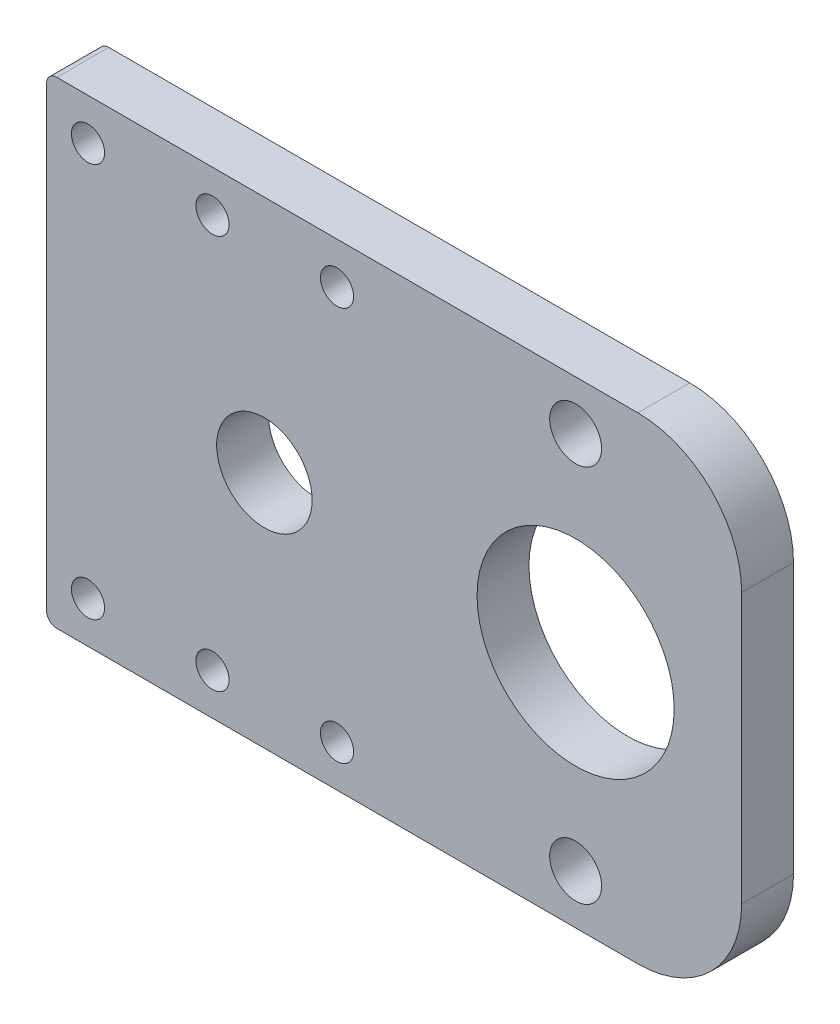
ISO-10303-21;
HEADER;
FILE_DESCRIPTION(('STEP AP214'),'2;1');
FILE_NAME('part.step','',(''),(''),'','','');
FILE_SCHEMA(('AUTOMOTIVE_DESIGN { 1 0 10303 214 1 1 1 1 }'));
ENDSEC;
DATA;
#1=APPLICATION_CONTEXT('core data for automotive mechanical design processes');
#2=APPLICATION_PROTOCOL_DEFINITION('international standard','automotive_design',2000,#1);
#3=PRODUCT_CONTEXT('',#1,'mechanical');
#4=PRODUCT('Part','Part','',(#3));
#5=PRODUCT_RELATED_PRODUCT_CATEGORY('part','',(#4));
#6=PRODUCT_DEFINITION_FORMATION('','',#4);
#7=PRODUCT_DEFINITION_CONTEXT('part definition',#1,'design');
#8=PRODUCT_DEFINITION('design','',#6,#7);
#9=PRODUCT_DEFINITION_SHAPE('','',#8);
#10=(LENGTH_UNIT() NAMED_UNIT(*) SI_UNIT(.MILLI.,.METRE.));
#11=(NAMED_UNIT(*) PLANE_ANGLE_UNIT() SI_UNIT($,.RADIAN.));
#12=(NAMED_UNIT(*) SI_UNIT($,.STERADIAN.) SOLID_ANGLE_UNIT());
#13=UNCERTAINTY_MEASURE_WITH_UNIT(LENGTH_MEASURE(1.E-05),#10,'distance_accuracy_value','');
#14=(GEOMETRIC_REPRESENTATION_CONTEXT(3) GLOBAL_UNCERTAINTY_ASSIGNED_CONTEXT((#13)) GLOBAL_UNIT_ASSIGNED_CONTEXT((#10,
#11,#12)) REPRESENTATION_CONTEXT('',''));
#15=CARTESIAN_POINT('',(0.,0.,0.));
#16=DIRECTION('',(0.,0.,1.));
#17=DIRECTION('',(1.,0.,0.));
#18=AXIS2_PLACEMENT_3D('',#15,#16,#17);
#19=CARTESIAN_POINT('',(0.,0.,5.));
#20=DIRECTION('',(0.,0.,1.));
#21=DIRECTION('',(1.,0.,0.));
#22=AXIS2_PLACEMENT_3D('',#19,#20,#21);
#23=PLANE('',#22);
#24=CARTESIAN_POINT('',(7.00000000000001,18.9999999999999,5.));
#25=DIRECTION('',(0.,0.,1.));
#26=DIRECTION('',(1.,0.,0.));
#27=AXIS2_PLACEMENT_3D('',#24,#25,#26);
#28=CIRCLE('',#27,1.6);
#29=CARTESIAN_POINT('',(8.60000000000001,18.9999999999999,5.));
#30=VERTEX_POINT('',#29);
#31=EDGE_CURVE('E181',#30,#30,#28,.F.);
#32=ORIENTED_EDGE('',*,*,#31,.T.);
#33=EDGE_LOOP('',(#32));
#34=FACE_BOUND('',#33,.T.);
#35=CARTESIAN_POINT('',(-4.99999999999999,-18.9999999999999,5.));
#36=DIRECTION('',(0.,0.,1.));
#37=DIRECTION('',(1.,0.,0.));
#38=AXIS2_PLACEMENT_3D('',#35,#36,#37);
#39=CIRCLE('',#38,1.6);
#40=CARTESIAN_POINT('',(-3.39999999999999,-18.9999999999999,5.));
#41=VERTEX_POINT('',#40);
#42=EDGE_CURVE('E174',#41,#41,#39,.F.);
#43=ORIENTED_EDGE('',*,*,#42,.T.);
#44=EDGE_LOOP('',(#43));
#45=FACE_BOUND('',#44,.T.);
#46=CARTESIAN_POINT('',(-17.,-18.9999999999999,5.));
#47=DIRECTION('',(0.,0.,1.));
#48=DIRECTION('',(1.,0.,0.));
#49=AXIS2_PLACEMENT_3D('',#46,#47,#48);
#50=CIRCLE('',#49,1.59999999999999);
#51=CARTESIAN_POINT('',(-15.4,-18.9999999999999,5.));
#52=VERTEX_POINT('',#51);
#53=EDGE_CURVE('E177',#52,#52,#50,.F.);
#54=ORIENTED_EDGE('',*,*,#53,.T.);
#55=EDGE_LOOP('',(#54));
#56=FACE_BOUND('',#55,.T.);
#57=CARTESIAN_POINT('',(30.,18.25,5.));
#58=DIRECTION('',(0.,0.,1.));
#59=DIRECTION('',(1.,0.,0.));
#60=AXIS2_PLACEMENT_3D('',#57,#58,#59);
#61=CIRCLE('',#60,2.5);
#62=CARTESIAN_POINT('',(32.5,18.25,5.));
#63=VERTEX_POINT('',#62);
#64=EDGE_CURVE('E192',#63,#63,#61,.T.);
#65=ORIENTED_EDGE('',*,*,#64,.F.);
#66=EDGE_LOOP('',(#65));
#67=FACE_BOUND('',#66,.T.);
#68=CARTESIAN_POINT('',(0.,0.,5.));
#69=DIRECTION('',(0.,0.,1.));
#70=DIRECTION('',(1.,0.,0.));
#71=AXIS2_PLACEMENT_3D('',#68,#69,#70);
#72=CIRCLE('',#71,4.6);
#73=CARTESIAN_POINT('',(4.6,0.,5.));
#74=VERTEX_POINT('',#73);
#75=EDGE_CURVE('E199',#74,#74,#72,.T.);
#76=ORIENTED_EDGE('',*,*,#75,.F.);
#77=EDGE_LOOP('',(#76));
#78=FACE_BOUND('',#77,.T.);
#79=CARTESIAN_POINT('',(30.,0.,5.));
#80=DIRECTION('',(0.,0.,1.));
#81=DIRECTION('',(1.,0.,0.));
#82=AXIS2_PLACEMENT_3D('',#79,#80,#81);
#83=CIRCLE('',#82,9.5);
#84=CARTESIAN_POINT('',(39.5,0.,5.));
#85=VERTEX_POINT('',#84);
#86=EDGE_CURVE('E202',#85,#85,#83,.T.);
#87=ORIENTED_EDGE('',*,*,#86,.F.);
#88=EDGE_LOOP('',(#87));
#89=FACE_BOUND('',#88,.T.);
#90=CARTESIAN_POINT('',(30.,-18.25,5.));
#91=DIRECTION('',(0.,0.,1.));
#92=DIRECTION('',(1.,0.,0.));
#93=AXIS2_PLACEMENT_3D('',#90,#91,#92);
#94=CIRCLE('',#93,2.5);
#95=CARTESIAN_POINT('',(32.5,-18.25,5.));
#96=VERTEX_POINT('',#95);
#97=EDGE_CURVE('E113',#96,#96,#94,.F.);
#98=ORIENTED_EDGE('',*,*,#97,.T.);
#99=EDGE_LOOP('',(#98));
#100=FACE_BOUND('',#99,.T.);
#101=CARTESIAN_POINT('',(7.00000000000001,-18.9999999999999,5.));
#102=DIRECTION('',(0.,0.,1.));
#103=DIRECTION('',(1.,0.,0.));
#104=AXIS2_PLACEMENT_3D('',#101,#102,#103);
#105=CIRCLE('',#104,1.6);
#106=CARTESIAN_POINT('',(8.60000000000001,-18.9999999999999,5.));
#107=VERTEX_POINT('',#106);
#108=EDGE_CURVE('E178',#107,#107,#105,.T.);
#109=ORIENTED_EDGE('',*,*,#108,.F.);
#110=EDGE_LOOP('',(#109));
#111=FACE_BOUND('',#110,.T.);
#112=CARTESIAN_POINT('',(-4.99999999999999,18.9999999999999,5.));
#113=DIRECTION('',(0.,0.,1.));
#114=DIRECTION('',(1.,0.,0.));
#115=AXIS2_PLACEMENT_3D('',#112,#113,#114);
#116=CIRCLE('',#115,1.6);
#117=CARTESIAN_POINT('',(-3.39999999999999,18.9999999999999,5.));
#118=VERTEX_POINT('',#117);
#119=EDGE_CURVE('E184',#118,#118,#116,.T.);
#120=ORIENTED_EDGE('',*,*,#119,.F.);
#121=EDGE_LOOP('',(#120));
#122=FACE_BOUND('',#121,.T.);
#123=CARTESIAN_POINT('',(-17.,18.9999999999999,5.));
#124=DIRECTION('',(0.,0.,1.));
#125=DIRECTION('',(1.,0.,0.));
#126=AXIS2_PLACEMENT_3D('',#123,#124,#125);
#127=CIRCLE('',#126,1.6);
#128=CARTESIAN_POINT('',(-15.4,18.9999999999999,5.));
#129=VERTEX_POINT('',#128);
#130=EDGE_CURVE('E170',#129,#129,#127,.T.);
#131=ORIENTED_EDGE('',*,*,#130,.F.);
#132=EDGE_LOOP('',(#131));
#133=FACE_BOUND('',#132,.T.);
#134=DIRECTION('',(-1.,0.,0.));
#135=VECTOR('',#134,1.);
#136=CARTESIAN_POINT('',(0.,23.,5.));
#137=LINE('',#136,#135);
#138=CARTESIAN_POINT('',(36.,23.,5.));
#139=VERTEX_POINT('',#138);
#140=CARTESIAN_POINT('',(-20.,23.,5.));
#141=VERTEX_POINT('',#140);
#142=EDGE_CURVE('E165',#139,#141,#137,.T.);
#143=ORIENTED_EDGE('',*,*,#142,.T.);
#144=CARTESIAN_POINT('',(-20.,22.,5.));
#145=DIRECTION('',(0.,0.,1.));
#146=DIRECTION('',(1.,0.,0.));
#147=AXIS2_PLACEMENT_3D('',#144,#145,#146);
#148=CIRCLE('',#147,1.);
#149=CARTESIAN_POINT('',(-21.,22.,5.));
#150=VERTEX_POINT('',#149);
#151=EDGE_CURVE('E139',#141,#150,#148,.T.);
#152=ORIENTED_EDGE('',*,*,#151,.T.);
#153=DIRECTION('',(0.,-1.,0.));
#154=VECTOR('',#153,1.);
#155=CARTESIAN_POINT('',(-21.,0.,5.));
#156=LINE('',#155,#154);
#157=CARTESIAN_POINT('',(-21.,-22.,5.));
#158=VERTEX_POINT('',#157);
#159=EDGE_CURVE('E120',#150,#158,#156,.T.);
#160=ORIENTED_EDGE('',*,*,#159,.T.);
#161=CARTESIAN_POINT('',(-20.,-22.,5.));
#162=DIRECTION('',(0.,0.,1.));
#163=DIRECTION('',(1.,0.,0.));
#164=AXIS2_PLACEMENT_3D('',#161,#162,#163);
#165=CIRCLE('',#164,1.);
#166=CARTESIAN_POINT('',(-20.,-23.,5.));
#167=VERTEX_POINT('',#166);
#168=EDGE_CURVE('E137',#158,#167,#165,.T.);
#169=ORIENTED_EDGE('',*,*,#168,.T.);
#170=DIRECTION('',(-1.,0.,0.));
#171=VECTOR('',#170,1.);
#172=CARTESIAN_POINT('',(0.,-23.,5.));
#173=LINE('',#172,#171);
#174=CARTESIAN_POINT('',(36.,-23.,5.));
#175=VERTEX_POINT('',#174);
#176=EDGE_CURVE('E197',#175,#167,#173,.T.);
#177=ORIENTED_EDGE('',*,*,#176,.F.);
#178=CARTESIAN_POINT('',(36.,-13.,5.));
#179=DIRECTION('',(0.,0.,1.));
#180=DIRECTION('',(1.,0.,0.));
#181=AXIS2_PLACEMENT_3D('',#178,#179,#180);
#182=CIRCLE('',#181,10.);
#183=CARTESIAN_POINT('',(46.,-13.,5.));
#184=VERTEX_POINT('',#183);
#185=EDGE_CURVE('E236',#175,#184,#182,.T.);
#186=ORIENTED_EDGE('',*,*,#185,.T.);
#187=DIRECTION('',(0.,-1.,0.));
#188=VECTOR('',#187,1.);
#189=CARTESIAN_POINT('',(46.,0.,5.));
#190=LINE('',#189,#188);
#191=CARTESIAN_POINT('',(46.,13.,5.));
#192=VERTEX_POINT('',#191);
#193=EDGE_CURVE('E109',#192,#184,#190,.T.);
#194=ORIENTED_EDGE('',*,*,#193,.F.);
#195=CARTESIAN_POINT('',(36.,13.,5.));
#196=DIRECTION('',(0.,0.,1.));
#197=DIRECTION('',(1.,0.,0.));
#198=AXIS2_PLACEMENT_3D('',#195,#196,#197);
#199=CIRCLE('',#198,10.);
#200=EDGE_CURVE('E129',#192,#139,#199,.T.);
#201=ORIENTED_EDGE('',*,*,#200,.T.);
#202=EDGE_LOOP('',(#143,#152,#160,#169,#177,#186,#194,#201));
#203=FACE_BOUND('',#202,.T.);
#204=ADVANCED_FACE('F35',(#34,#45,#56,#67,#78,#89,#100,#111,#122,#133,#203),#23,.T.);
#205=CARTESIAN_POINT('',(0.,0.,0.));
#206=DIRECTION('',(0.,0.,1.));
#207=DIRECTION('',(1.,0.,0.));
#208=AXIS2_PLACEMENT_3D('',#205,#206,#207);
#209=PLANE('',#208);
#210=CARTESIAN_POINT('',(-17.,18.9999999999999,0.));
#211=DIRECTION('',(0.,0.,1.));
#212=DIRECTION('',(1.,0.,0.));
#213=AXIS2_PLACEMENT_3D('',#210,#211,#212);
#214=CIRCLE('',#213,1.6);
#215=CARTESIAN_POINT('',(-15.4,18.9999999999999,0.));
#216=VERTEX_POINT('',#215);
#217=EDGE_CURVE('E208',#216,#216,#214,.T.);
#218=ORIENTED_EDGE('',*,*,#217,.T.);
#219=EDGE_LOOP('',(#218));
#220=FACE_BOUND('',#219,.T.);
#221=CARTESIAN_POINT('',(7.00000000000001,-18.9999999999999,0.));
#222=DIRECTION('',(0.,0.,1.));
#223=DIRECTION('',(1.,0.,0.));
#224=AXIS2_PLACEMENT_3D('',#221,#222,#223);
#225=CIRCLE('',#224,1.6);
#226=CARTESIAN_POINT('',(8.60000000000001,-18.9999999999999,0.));
#227=VERTEX_POINT('',#226);
#228=EDGE_CURVE('E224',#227,#227,#225,.T.);
#229=ORIENTED_EDGE('',*,*,#228,.T.);
#230=EDGE_LOOP('',(#229));
#231=FACE_BOUND('',#230,.T.);
#232=CARTESIAN_POINT('',(-4.99999999999999,-18.9999999999999,0.));
#233=DIRECTION('',(0.,0.,1.));
#234=DIRECTION('',(1.,0.,0.));
#235=AXIS2_PLACEMENT_3D('',#232,#233,#234);
#236=CIRCLE('',#235,1.6);
#237=CARTESIAN_POINT('',(-3.39999999999999,-18.9999999999999,0.));
#238=VERTEX_POINT('',#237);
#239=EDGE_CURVE('E221',#238,#238,#236,.F.);
#240=ORIENTED_EDGE('',*,*,#239,.F.);
#241=EDGE_LOOP('',(#240));
#242=FACE_BOUND('',#241,.T.);
#243=CARTESIAN_POINT('',(-17.,-18.9999999999999,0.));
#244=DIRECTION('',(0.,0.,1.));
#245=DIRECTION('',(1.,0.,0.));
#246=AXIS2_PLACEMENT_3D('',#243,#244,#245);
#247=CIRCLE('',#246,1.59999999999999);
#248=CARTESIAN_POINT('',(-15.4,-18.9999999999999,0.));
#249=VERTEX_POINT('',#248);
#250=EDGE_CURVE('E191',#249,#249,#247,.F.);
#251=ORIENTED_EDGE('',*,*,#250,.F.);
#252=EDGE_LOOP('',(#251));
#253=FACE_BOUND('',#252,.T.);
#254=CARTESIAN_POINT('',(30.,18.25,0.));
#255=DIRECTION('',(0.,0.,1.));
#256=DIRECTION('',(1.,0.,0.));
#257=AXIS2_PLACEMENT_3D('',#254,#255,#256);
#258=CIRCLE('',#257,2.5);
#259=CARTESIAN_POINT('',(32.5,18.25,0.));
#260=VERTEX_POINT('',#259);
#261=EDGE_CURVE('E159',#260,#260,#258,.T.);
#262=ORIENTED_EDGE('',*,*,#261,.T.);
#263=EDGE_LOOP('',(#262));
#264=FACE_BOUND('',#263,.T.);
#265=CARTESIAN_POINT('',(0.,0.,0.));
#266=DIRECTION('',(0.,0.,1.));
#267=DIRECTION('',(1.,0.,0.));
#268=AXIS2_PLACEMENT_3D('',#265,#266,#267);
#269=CIRCLE('',#268,4.6);
#270=CARTESIAN_POINT('',(4.6,0.,0.));
#271=VERTEX_POINT('',#270);
#272=EDGE_CURVE('E211',#271,#271,#269,.T.);
#273=ORIENTED_EDGE('',*,*,#272,.T.);
#274=EDGE_LOOP('',(#273));
#275=FACE_BOUND('',#274,.T.);
#276=CARTESIAN_POINT('',(30.,0.,0.));
#277=DIRECTION('',(0.,0.,1.));
#278=DIRECTION('',(1.,0.,0.));
#279=AXIS2_PLACEMENT_3D('',#276,#277,#278);
#280=CIRCLE('',#279,9.5);
#281=CARTESIAN_POINT('',(39.5,0.,0.));
#282=VERTEX_POINT('',#281);
#283=EDGE_CURVE('E214',#282,#282,#280,.T.);
#284=ORIENTED_EDGE('',*,*,#283,.T.);
#285=EDGE_LOOP('',(#284));
#286=FACE_BOUND('',#285,.T.);
#287=CARTESIAN_POINT('',(30.,-18.25,0.));
#288=DIRECTION('',(0.,0.,1.));
#289=DIRECTION('',(1.,0.,0.));
#290=AXIS2_PLACEMENT_3D('',#287,#288,#289);
#291=CIRCLE('',#290,2.5);
#292=CARTESIAN_POINT('',(32.5,-18.25,0.));
#293=VERTEX_POINT('',#292);
#294=EDGE_CURVE('E195',#293,#293,#291,.F.);
#295=ORIENTED_EDGE('',*,*,#294,.F.);
#296=EDGE_LOOP('',(#295));
#297=FACE_BOUND('',#296,.T.);
#298=CARTESIAN_POINT('',(7.00000000000001,18.9999999999999,0.));
#299=DIRECTION('',(0.,0.,1.));
#300=DIRECTION('',(1.,0.,0.));
#301=AXIS2_PLACEMENT_3D('',#298,#299,#300);
#302=CIRCLE('',#301,1.6);
#303=CARTESIAN_POINT('',(8.60000000000001,18.9999999999999,0.));
#304=VERTEX_POINT('',#303);
#305=EDGE_CURVE('E227',#304,#304,#302,.F.);
#306=ORIENTED_EDGE('',*,*,#305,.F.);
#307=EDGE_LOOP('',(#306));
#308=FACE_BOUND('',#307,.T.);
#309=CARTESIAN_POINT('',(-4.99999999999999,18.9999999999999,0.));
#310=DIRECTION('',(0.,0.,1.));
#311=DIRECTION('',(1.,0.,0.));
#312=AXIS2_PLACEMENT_3D('',#309,#310,#311);
#313=CIRCLE('',#312,1.6);
#314=CARTESIAN_POINT('',(-3.39999999999999,18.9999999999999,0.));
#315=VERTEX_POINT('',#314);
#316=EDGE_CURVE('E230',#315,#315,#313,.T.);
#317=ORIENTED_EDGE('',*,*,#316,.T.);
#318=EDGE_LOOP('',(#317));
#319=FACE_BOUND('',#318,.T.);
#320=DIRECTION('',(0.,-1.,0.));
#321=VECTOR('',#320,1.);
#322=CARTESIAN_POINT('',(-21.,0.,0.));
#323=LINE('',#322,#321);
#324=CARTESIAN_POINT('',(-21.,22.,0.));
#325=VERTEX_POINT('',#324);
#326=CARTESIAN_POINT('',(-21.,-22.,0.));
#327=VERTEX_POINT('',#326);
#328=EDGE_CURVE('E149',#325,#327,#323,.T.);
#329=ORIENTED_EDGE('',*,*,#328,.F.);
#330=CARTESIAN_POINT('',(-20.,22.,0.));
#331=DIRECTION('',(0.,0.,1.));
#332=DIRECTION('',(1.,0.,0.));
#333=AXIS2_PLACEMENT_3D('',#330,#331,#332);
#334=CIRCLE('',#333,1.);
#335=CARTESIAN_POINT('',(-20.,23.,0.));
#336=VERTEX_POINT('',#335);
#337=EDGE_CURVE('E43',#325,#336,#334,.F.);
#338=ORIENTED_EDGE('',*,*,#337,.T.);
#339=DIRECTION('',(-1.,0.,0.));
#340=VECTOR('',#339,1.);
#341=CARTESIAN_POINT('',(0.,23.,0.));
#342=LINE('',#341,#340);
#343=CARTESIAN_POINT('',(36.,23.,0.));
#344=VERTEX_POINT('',#343);
#345=EDGE_CURVE('E148',#344,#336,#342,.T.);
#346=ORIENTED_EDGE('',*,*,#345,.F.);
#347=CARTESIAN_POINT('',(36.,13.,0.));
#348=DIRECTION('',(0.,0.,1.));
#349=DIRECTION('',(1.,0.,0.));
#350=AXIS2_PLACEMENT_3D('',#347,#348,#349);
#351=CIRCLE('',#350,10.);
#352=CARTESIAN_POINT('',(46.,13.,0.));
#353=VERTEX_POINT('',#352);
#354=EDGE_CURVE('E119',#344,#353,#351,.F.);
#355=ORIENTED_EDGE('',*,*,#354,.T.);
#356=DIRECTION('',(0.,1.,0.));
#357=VECTOR('',#356,1.);
#358=CARTESIAN_POINT('',(46.,0.,0.));
#359=LINE('',#358,#357);
#360=CARTESIAN_POINT('',(46.,-13.,0.));
#361=VERTEX_POINT('',#360);
#362=EDGE_CURVE('E106',#361,#353,#359,.T.);
#363=ORIENTED_EDGE('',*,*,#362,.F.);
#364=CARTESIAN_POINT('',(36.,-13.,0.));
#365=DIRECTION('',(0.,0.,1.));
#366=DIRECTION('',(1.,0.,0.));
#367=AXIS2_PLACEMENT_3D('',#364,#365,#366);
#368=CIRCLE('',#367,10.);
#369=CARTESIAN_POINT('',(36.,-23.,0.));
#370=VERTEX_POINT('',#369);
#371=EDGE_CURVE('E116',#361,#370,#368,.F.);
#372=ORIENTED_EDGE('',*,*,#371,.T.);
#373=DIRECTION('',(-1.,0.,0.));
#374=VECTOR('',#373,1.);
#375=CARTESIAN_POINT('',(0.,-23.,0.));
#376=LINE('',#375,#374);
#377=CARTESIAN_POINT('',(-20.,-23.,0.));
#378=VERTEX_POINT('',#377);
#379=EDGE_CURVE('E158',#370,#378,#376,.T.);
#380=ORIENTED_EDGE('',*,*,#379,.T.);
#381=CARTESIAN_POINT('',(-20.,-22.,0.));
#382=DIRECTION('',(0.,0.,1.));
#383=DIRECTION('',(1.,0.,0.));
#384=AXIS2_PLACEMENT_3D('',#381,#382,#383);
#385=CIRCLE('',#384,1.);
#386=EDGE_CURVE('E55',#378,#327,#385,.F.);
#387=ORIENTED_EDGE('',*,*,#386,.T.);
#388=EDGE_LOOP('',(#329,#338,#346,#355,#363,#372,#380,#387));
#389=FACE_BOUND('',#388,.T.);
#390=ADVANCED_FACE('F115',(#220,#231,#242,#253,#264,#275,#286,#297,#308,#319,#389),#209,.F.);
#391=CARTESIAN_POINT('',(0.,23.,5.));
#392=DIRECTION('',(0.,-1.,0.));
#393=DIRECTION('',(1.,0.,0.));
#394=AXIS2_PLACEMENT_3D('',#391,#392,#393);
#395=PLANE('',#394);
#396=ORIENTED_EDGE('',*,*,#345,.T.);
#397=DIRECTION('',(0.,0.,1.));
#398=VECTOR('',#397,1.);
#399=CARTESIAN_POINT('',(-20.,23.,5.));
#400=LINE('',#399,#398);
#401=EDGE_CURVE('E134',#336,#141,#400,.T.);
#402=ORIENTED_EDGE('',*,*,#401,.T.);
#403=ORIENTED_EDGE('',*,*,#142,.F.);
#404=DIRECTION('',(0.,0.,1.));
#405=VECTOR('',#404,1.);
#406=CARTESIAN_POINT('',(36.,23.,5.));
#407=LINE('',#406,#405);
#408=EDGE_CURVE('E126',#139,#344,#407,.F.);
#409=ORIENTED_EDGE('',*,*,#408,.T.);
#410=EDGE_LOOP('',(#396,#402,#403,#409));
#411=FACE_BOUND('',#410,.T.);
#412=ADVANCED_FACE('F154',(#411),#395,.F.);
#413=CARTESIAN_POINT('',(0.,-23.,5.));
#414=DIRECTION('',(0.,-1.,0.));
#415=DIRECTION('',(1.,0.,0.));
#416=AXIS2_PLACEMENT_3D('',#413,#414,#415);
#417=PLANE('',#416);
#418=ORIENTED_EDGE('',*,*,#176,.T.);
#419=DIRECTION('',(0.,0.,1.));
#420=VECTOR('',#419,1.);
#421=CARTESIAN_POINT('',(-20.,-23.,5.));
#422=LINE('',#421,#420);
#423=EDGE_CURVE('E11',#167,#378,#422,.F.);
#424=ORIENTED_EDGE('',*,*,#423,.T.);
#425=ORIENTED_EDGE('',*,*,#379,.F.);
#426=DIRECTION('',(0.,0.,1.));
#427=VECTOR('',#426,1.);
#428=CARTESIAN_POINT('',(36.,-23.,5.));
#429=LINE('',#428,#427);
#430=EDGE_CURVE('E125',#370,#175,#429,.T.);
#431=ORIENTED_EDGE('',*,*,#430,.T.);
#432=EDGE_LOOP('',(#418,#424,#425,#431));
#433=FACE_BOUND('',#432,.T.);
#434=ADVANCED_FACE('F270',(#433),#417,.T.);
#435=CARTESIAN_POINT('',(30.,0.,5.));
#436=DIRECTION('',(0.,0.,-1.));
#437=DIRECTION('',(-1.,0.,0.));
#438=AXIS2_PLACEMENT_3D('',#435,#436,#437);
#439=CYLINDRICAL_SURFACE('',#438,9.5);
#440=ORIENTED_EDGE('',*,*,#86,.T.);
#441=EDGE_LOOP('',(#440));
#442=FACE_BOUND('',#441,.T.);
#443=ORIENTED_EDGE('',*,*,#283,.F.);
#444=EDGE_LOOP('',(#443));
#445=FACE_BOUND('',#444,.T.);
#446=ADVANCED_FACE('F266',(#442,#445),#439,.F.);
#447=CARTESIAN_POINT('',(0.,0.,5.));
#448=DIRECTION('',(0.,0.,-1.));
#449=DIRECTION('',(-1.,0.,0.));
#450=AXIS2_PLACEMENT_3D('',#447,#448,#449);
#451=CYLINDRICAL_SURFACE('',#450,4.6);
#452=ORIENTED_EDGE('',*,*,#75,.T.);
#453=EDGE_LOOP('',(#452));
#454=FACE_BOUND('',#453,.T.);
#455=ORIENTED_EDGE('',*,*,#272,.F.);
#456=EDGE_LOOP('',(#455));
#457=FACE_BOUND('',#456,.T.);
#458=ADVANCED_FACE('F269',(#454,#457),#451,.F.);
#459=CARTESIAN_POINT('',(30.,18.25,5.));
#460=DIRECTION('',(0.,0.,-1.));
#461=DIRECTION('',(-1.,0.,0.));
#462=AXIS2_PLACEMENT_3D('',#459,#460,#461);
#463=CYLINDRICAL_SURFACE('',#462,2.5);
#464=ORIENTED_EDGE('',*,*,#64,.T.);
#465=EDGE_LOOP('',(#464));
#466=FACE_BOUND('',#465,.T.);
#467=ORIENTED_EDGE('',*,*,#261,.F.);
#468=EDGE_LOOP('',(#467));
#469=FACE_BOUND('',#468,.T.);
#470=ADVANCED_FACE('F264',(#466,#469),#463,.F.);
#471=CARTESIAN_POINT('',(30.,-18.25,5.));
#472=DIRECTION('',(0.,0.,-1.));
#473=DIRECTION('',(-1.,0.,0.));
#474=AXIS2_PLACEMENT_3D('',#471,#472,#473);
#475=CYLINDRICAL_SURFACE('',#474,2.5);
#476=ORIENTED_EDGE('',*,*,#97,.F.);
#477=EDGE_LOOP('',(#476));
#478=FACE_BOUND('',#477,.T.);
#479=ORIENTED_EDGE('',*,*,#294,.T.);
#480=EDGE_LOOP('',(#479));
#481=FACE_BOUND('',#480,.T.);
#482=ADVANCED_FACE('F261',(#478,#481),#475,.F.);
#483=CARTESIAN_POINT('',(-17.,-18.9999999999999,-5.));
#484=DIRECTION('',(0.,0.,1.));
#485=DIRECTION('',(1.,0.,0.));
#486=AXIS2_PLACEMENT_3D('',#483,#484,#485);
#487=CYLINDRICAL_SURFACE('',#486,1.59999999999999);
#488=ORIENTED_EDGE('',*,*,#53,.F.);
#489=EDGE_LOOP('',(#488));
#490=FACE_BOUND('',#489,.T.);
#491=ORIENTED_EDGE('',*,*,#250,.T.);
#492=EDGE_LOOP('',(#491));
#493=FACE_BOUND('',#492,.T.);
#494=ADVANCED_FACE('F258',(#490,#493),#487,.F.);
#495=CARTESIAN_POINT('',(-4.99999999999999,-18.9999999999999,-5.));
#496=DIRECTION('',(0.,0.,1.));
#497=DIRECTION('',(1.,0.,0.));
#498=AXIS2_PLACEMENT_3D('',#495,#496,#497);
#499=CYLINDRICAL_SURFACE('',#498,1.6);
#500=ORIENTED_EDGE('',*,*,#42,.F.);
#501=EDGE_LOOP('',(#500));
#502=FACE_BOUND('',#501,.T.);
#503=ORIENTED_EDGE('',*,*,#239,.T.);
#504=EDGE_LOOP('',(#503));
#505=FACE_BOUND('',#504,.T.);
#506=ADVANCED_FACE('F314',(#502,#505),#499,.F.);
#507=CARTESIAN_POINT('',(7.00000000000001,-18.9999999999999,-5.));
#508=DIRECTION('',(0.,0.,1.));
#509=DIRECTION('',(1.,0.,0.));
#510=AXIS2_PLACEMENT_3D('',#507,#508,#509);
#511=CYLINDRICAL_SURFACE('',#510,1.6);
#512=ORIENTED_EDGE('',*,*,#108,.T.);
#513=EDGE_LOOP('',(#512));
#514=FACE_BOUND('',#513,.T.);
#515=ORIENTED_EDGE('',*,*,#228,.F.);
#516=EDGE_LOOP('',(#515));
#517=FACE_BOUND('',#516,.T.);
#518=ADVANCED_FACE('F308',(#514,#517),#511,.F.);
#519=CARTESIAN_POINT('',(7.00000000000001,18.9999999999999,-5.));
#520=DIRECTION('',(0.,0.,1.));
#521=DIRECTION('',(1.,0.,0.));
#522=AXIS2_PLACEMENT_3D('',#519,#520,#521);
#523=CYLINDRICAL_SURFACE('',#522,1.6);
#524=ORIENTED_EDGE('',*,*,#31,.F.);
#525=EDGE_LOOP('',(#524));
#526=FACE_BOUND('',#525,.T.);
#527=ORIENTED_EDGE('',*,*,#305,.T.);
#528=EDGE_LOOP('',(#527));
#529=FACE_BOUND('',#528,.T.);
#530=ADVANCED_FACE('F300',(#526,#529),#523,.F.);
#531=CARTESIAN_POINT('',(-4.99999999999999,18.9999999999999,-5.));
#532=DIRECTION('',(0.,0.,1.));
#533=DIRECTION('',(1.,0.,0.));
#534=AXIS2_PLACEMENT_3D('',#531,#532,#533);
#535=CYLINDRICAL_SURFACE('',#534,1.6);
#536=ORIENTED_EDGE('',*,*,#119,.T.);
#537=EDGE_LOOP('',(#536));
#538=FACE_BOUND('',#537,.T.);
#539=ORIENTED_EDGE('',*,*,#316,.F.);
#540=EDGE_LOOP('',(#539));
#541=FACE_BOUND('',#540,.T.);
#542=ADVANCED_FACE('F297',(#538,#541),#535,.F.);
#543=CARTESIAN_POINT('',(-17.,18.9999999999999,-5.));
#544=DIRECTION('',(0.,0.,1.));
#545=DIRECTION('',(1.,0.,0.));
#546=AXIS2_PLACEMENT_3D('',#543,#544,#545);
#547=CYLINDRICAL_SURFACE('',#546,1.6);
#548=ORIENTED_EDGE('',*,*,#130,.T.);
#549=EDGE_LOOP('',(#548));
#550=FACE_BOUND('',#549,.T.);
#551=ORIENTED_EDGE('',*,*,#217,.F.);
#552=EDGE_LOOP('',(#551));
#553=FACE_BOUND('',#552,.T.);
#554=ADVANCED_FACE('F299',(#550,#553),#547,.F.);
#555=CARTESIAN_POINT('',(-21.,0.,0.));
#556=DIRECTION('',(-1.,0.,0.));
#557=DIRECTION('',(0.,-1.,0.));
#558=AXIS2_PLACEMENT_3D('',#555,#556,#557);
#559=PLANE('',#558);
#560=ORIENTED_EDGE('',*,*,#159,.F.);
#561=DIRECTION('',(0.,0.,1.));
#562=VECTOR('',#561,1.);
#563=CARTESIAN_POINT('',(-21.,22.,0.));
#564=LINE('',#563,#562);
#565=EDGE_CURVE('E144',#150,#325,#564,.F.);
#566=ORIENTED_EDGE('',*,*,#565,.T.);
#567=ORIENTED_EDGE('',*,*,#328,.T.);
#568=DIRECTION('',(0.,0.,1.));
#569=VECTOR('',#568,1.);
#570=CARTESIAN_POINT('',(-21.,-22.,0.));
#571=LINE('',#570,#569);
#572=EDGE_CURVE('E141',#327,#158,#571,.T.);
#573=ORIENTED_EDGE('',*,*,#572,.T.);
#574=EDGE_LOOP('',(#560,#566,#567,#573));
#575=FACE_BOUND('',#574,.T.);
#576=ADVANCED_FACE('F167',(#575),#559,.T.);
#577=CARTESIAN_POINT('',(46.,0.,-46.3896540189728));
#578=DIRECTION('',(-1.,0.,0.));
#579=DIRECTION('',(0.,0.,1.));
#580=AXIS2_PLACEMENT_3D('',#577,#578,#579);
#581=PLANE('',#580);
#582=ORIENTED_EDGE('',*,*,#362,.T.);
#583=DIRECTION('',(0.,0.,1.));
#584=VECTOR('',#583,1.);
#585=CARTESIAN_POINT('',(46.,13.,-46.3896540189728));
#586=LINE('',#585,#584);
#587=EDGE_CURVE('E112',#353,#192,#586,.T.);
#588=ORIENTED_EDGE('',*,*,#587,.T.);
#589=ORIENTED_EDGE('',*,*,#193,.T.);
#590=DIRECTION('',(0.,0.,1.));
#591=VECTOR('',#590,1.);
#592=CARTESIAN_POINT('',(46.,-13.,0.));
#593=LINE('',#592,#591);
#594=EDGE_CURVE('E102',#184,#361,#593,.F.);
#595=ORIENTED_EDGE('',*,*,#594,.T.);
#596=EDGE_LOOP('',(#582,#588,#589,#595));
#597=FACE_BOUND('',#596,.T.);
#598=ADVANCED_FACE('F104',(#597),#581,.F.);
#599=CARTESIAN_POINT('',(36.,13.,-46.3896540189728));
#600=DIRECTION('',(0.,0.,1.));
#601=DIRECTION('',(1.,0.,0.));
#602=AXIS2_PLACEMENT_3D('',#599,#600,#601);
#603=CYLINDRICAL_SURFACE('',#602,10.);
#604=ORIENTED_EDGE('',*,*,#354,.F.);
#605=ORIENTED_EDGE('',*,*,#408,.F.);
#606=ORIENTED_EDGE('',*,*,#200,.F.);
#607=ORIENTED_EDGE('',*,*,#587,.F.);
#608=EDGE_LOOP('',(#604,#605,#606,#607));
#609=FACE_BOUND('',#608,.T.);
#610=ADVANCED_FACE('F238',(#609),#603,.T.);
#611=CARTESIAN_POINT('',(36.,-13.,5.));
#612=DIRECTION('',(0.,0.,-1.));
#613=DIRECTION('',(-1.,0.,0.));
#614=AXIS2_PLACEMENT_3D('',#611,#612,#613);
#615=CYLINDRICAL_SURFACE('',#614,10.);
#616=ORIENTED_EDGE('',*,*,#371,.F.);
#617=ORIENTED_EDGE('',*,*,#594,.F.);
#618=ORIENTED_EDGE('',*,*,#185,.F.);
#619=ORIENTED_EDGE('',*,*,#430,.F.);
#620=EDGE_LOOP('',(#616,#617,#618,#619));
#621=FACE_BOUND('',#620,.T.);
#622=ADVANCED_FACE('F123',(#621),#615,.T.);
#623=CARTESIAN_POINT('',(-20.,22.,5.));
#624=DIRECTION('',(0.,0.,-1.));
#625=DIRECTION('',(-1.,0.,0.));
#626=AXIS2_PLACEMENT_3D('',#623,#624,#625);
#627=CYLINDRICAL_SURFACE('',#626,1.);
#628=ORIENTED_EDGE('',*,*,#337,.F.);
#629=ORIENTED_EDGE('',*,*,#565,.F.);
#630=ORIENTED_EDGE('',*,*,#151,.F.);
#631=ORIENTED_EDGE('',*,*,#401,.F.);
#632=EDGE_LOOP('',(#628,#629,#630,#631));
#633=FACE_BOUND('',#632,.T.);
#634=ADVANCED_FACE('F161',(#633),#627,.T.);
#635=CARTESIAN_POINT('',(-20.,-22.,0.));
#636=DIRECTION('',(0.,0.,1.));
#637=DIRECTION('',(1.,0.,0.));
#638=AXIS2_PLACEMENT_3D('',#635,#636,#637);
#639=CYLINDRICAL_SURFACE('',#638,1.);
#640=ORIENTED_EDGE('',*,*,#386,.F.);
#641=ORIENTED_EDGE('',*,*,#423,.F.);
#642=ORIENTED_EDGE('',*,*,#168,.F.);
#643=ORIENTED_EDGE('',*,*,#572,.F.);
#644=EDGE_LOOP('',(#640,#641,#642,#643));
#645=FACE_BOUND('',#644,.T.);
#646=ADVANCED_FACE('F37',(#645),#639,.T.);
#647=CLOSED_SHELL('',(#204,#390,#412,#434,#446,#458,#470,#482,#494,#506,#518,#530,#542,#554,
#576,#598,#610,#622,#634,#646));
#648=MANIFOLD_SOLID_BREP('B2',#647);
#649=ADVANCED_BREP_SHAPE_REPRESENTATION('',(#18,#648),#14);
#650=SHAPE_DEFINITION_REPRESENTATION(#9,#649);
ENDSEC;
END-ISO-10303-21;
